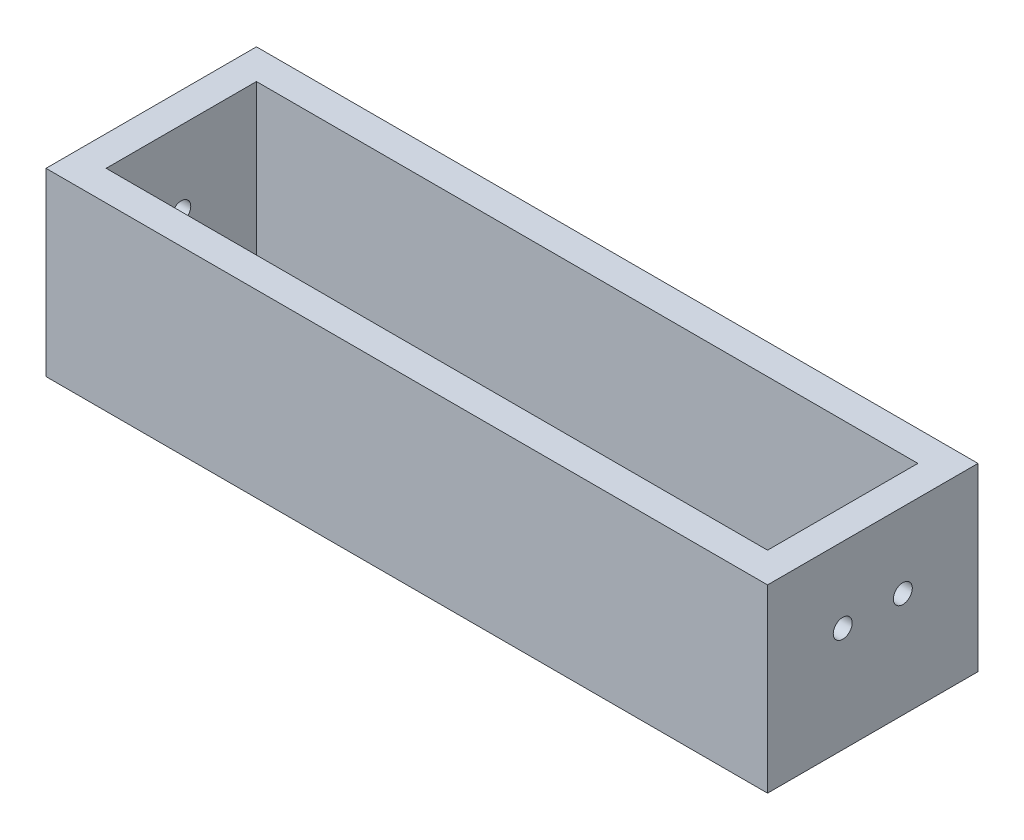
ISO-10303-21;
HEADER;
FILE_DESCRIPTION(('STEP AP214'),'2;1');
FILE_NAME('part.step','',(''),(''),'','','');
FILE_SCHEMA(('AUTOMOTIVE_DESIGN { 1 0 10303 214 1 1 1 1 }'));
ENDSEC;
DATA;
#1=APPLICATION_CONTEXT('core data for automotive mechanical design processes');
#2=APPLICATION_PROTOCOL_DEFINITION('international standard','automotive_design',2000,#1);
#3=PRODUCT_CONTEXT('',#1,'mechanical');
#4=PRODUCT('Part','Part','',(#3));
#5=PRODUCT_RELATED_PRODUCT_CATEGORY('part','',(#4));
#6=PRODUCT_DEFINITION_FORMATION('','',#4);
#7=PRODUCT_DEFINITION_CONTEXT('part definition',#1,'design');
#8=PRODUCT_DEFINITION('design','',#6,#7);
#9=PRODUCT_DEFINITION_SHAPE('','',#8);
#10=(LENGTH_UNIT() NAMED_UNIT(*) SI_UNIT(.MILLI.,.METRE.));
#11=(NAMED_UNIT(*) PLANE_ANGLE_UNIT() SI_UNIT($,.RADIAN.));
#12=(NAMED_UNIT(*) SI_UNIT($,.STERADIAN.) SOLID_ANGLE_UNIT());
#13=UNCERTAINTY_MEASURE_WITH_UNIT(LENGTH_MEASURE(1.E-05),#10,'distance_accuracy_value','');
#14=(GEOMETRIC_REPRESENTATION_CONTEXT(3) GLOBAL_UNCERTAINTY_ASSIGNED_CONTEXT((#13)) GLOBAL_UNIT_ASSIGNED_CONTEXT((#10,
#11,#12)) REPRESENTATION_CONTEXT('',''));
#15=CARTESIAN_POINT('',(0.,0.,0.));
#16=DIRECTION('',(0.,0.,1.));
#17=DIRECTION('',(1.,0.,0.));
#18=AXIS2_PLACEMENT_3D('',#15,#16,#17);
#19=CARTESIAN_POINT('',(38.1,3.175,11.1125));
#20=DIRECTION('',(-1.,0.,0.));
#21=DIRECTION('',(0.,0.,1.));
#22=AXIS2_PLACEMENT_3D('',#19,#20,#21);
#23=PLANE('',#22);
#24=CARTESIAN_POINT('',(38.1,11.1125,-3.175));
#25=DIRECTION('',(-1.,0.,0.));
#26=DIRECTION('',(0.,0.,1.));
#27=AXIS2_PLACEMENT_3D('',#24,#25,#26);
#28=CIRCLE('',#27,1.);
#29=CARTESIAN_POINT('',(38.1,11.1125,-2.175));
#30=VERTEX_POINT('',#29);
#31=EDGE_CURVE('E170',#30,#30,#28,.T.);
#32=ORIENTED_EDGE('',*,*,#31,.T.);
#33=EDGE_LOOP('',(#32));
#34=FACE_BOUND('',#33,.T.);
#35=CARTESIAN_POINT('',(38.1,11.1125,3.175));
#36=DIRECTION('',(-1.,0.,0.));
#37=DIRECTION('',(0.,0.,1.));
#38=AXIS2_PLACEMENT_3D('',#35,#36,#37);
#39=CIRCLE('',#38,1.);
#40=CARTESIAN_POINT('',(38.1,11.1125,4.175));
#41=VERTEX_POINT('',#40);
#42=EDGE_CURVE('E232',#41,#41,#39,.T.);
#43=ORIENTED_EDGE('',*,*,#42,.T.);
#44=EDGE_LOOP('',(#43));
#45=FACE_BOUND('',#44,.T.);
#46=DIRECTION('',(0.,0.,-1.));
#47=VECTOR('',#46,1.);
#48=CARTESIAN_POINT('',(38.1,0.,11.1125));
#49=LINE('',#48,#47);
#50=CARTESIAN_POINT('',(38.1,0.,11.1125));
#51=VERTEX_POINT('',#50);
#52=CARTESIAN_POINT('',(38.1,0.,-11.1125));
#53=VERTEX_POINT('',#52);
#54=EDGE_CURVE('E120',#51,#53,#49,.T.);
#55=ORIENTED_EDGE('',*,*,#54,.T.);
#56=DIRECTION('',(0.,-1.,0.));
#57=VECTOR('',#56,1.);
#58=CARTESIAN_POINT('',(38.1,3.175,-11.1125));
#59=LINE('',#58,#57);
#60=CARTESIAN_POINT('',(38.1,19.05,-11.1125));
#61=VERTEX_POINT('',#60);
#62=EDGE_CURVE('E11',#61,#53,#59,.T.);
#63=ORIENTED_EDGE('',*,*,#62,.F.);
#64=DIRECTION('',(0.,0.,-1.));
#65=VECTOR('',#64,1.);
#66=CARTESIAN_POINT('',(38.1,19.05,0.));
#67=LINE('',#66,#65);
#68=CARTESIAN_POINT('',(38.1,19.05,11.1125));
#69=VERTEX_POINT('',#68);
#70=EDGE_CURVE('E160',#69,#61,#67,.T.);
#71=ORIENTED_EDGE('',*,*,#70,.F.);
#72=DIRECTION('',(0.,-1.,0.));
#73=VECTOR('',#72,1.);
#74=CARTESIAN_POINT('',(38.1,3.175,11.1125));
#75=LINE('',#74,#73);
#76=EDGE_CURVE('E134',#69,#51,#75,.T.);
#77=ORIENTED_EDGE('',*,*,#76,.T.);
#78=EDGE_LOOP('',(#55,#63,#71,#77));
#79=FACE_BOUND('',#78,.T.);
#80=ADVANCED_FACE('F33',(#34,#45,#79),#23,.F.);
#81=CARTESIAN_POINT('',(-38.1,3.175,-11.1125));
#82=DIRECTION('',(0.,0.,1.));
#83=DIRECTION('',(1.,0.,0.));
#84=AXIS2_PLACEMENT_3D('',#81,#82,#83);
#85=PLANE('',#84);
#86=DIRECTION('',(-1.,0.,0.));
#87=VECTOR('',#86,1.);
#88=CARTESIAN_POINT('',(-38.1,0.,-11.1125));
#89=LINE('',#88,#87);
#90=CARTESIAN_POINT('',(-38.1,0.,-11.1125));
#91=VERTEX_POINT('',#90);
#92=EDGE_CURVE('E123',#53,#91,#89,.T.);
#93=ORIENTED_EDGE('',*,*,#92,.T.);
#94=DIRECTION('',(0.,-1.,0.));
#95=VECTOR('',#94,1.);
#96=CARTESIAN_POINT('',(-38.1,3.175,-11.1125));
#97=LINE('',#96,#95);
#98=CARTESIAN_POINT('',(-38.1,19.05,-11.1125));
#99=VERTEX_POINT('',#98);
#100=EDGE_CURVE('E40',#99,#91,#97,.T.);
#101=ORIENTED_EDGE('',*,*,#100,.F.);
#102=DIRECTION('',(-1.,0.,0.));
#103=VECTOR('',#102,1.);
#104=CARTESIAN_POINT('',(0.,19.05,-11.1125));
#105=LINE('',#104,#103);
#106=EDGE_CURVE('E161',#61,#99,#105,.T.);
#107=ORIENTED_EDGE('',*,*,#106,.F.);
#108=ORIENTED_EDGE('',*,*,#62,.T.);
#109=EDGE_LOOP('',(#93,#101,#107,#108));
#110=FACE_BOUND('',#109,.T.);
#111=ADVANCED_FACE('F182',(#110),#85,.F.);
#112=CARTESIAN_POINT('',(-38.1,3.175,11.1125));
#113=DIRECTION('',(1.,0.,0.));
#114=DIRECTION('',(0.,0.,-1.));
#115=AXIS2_PLACEMENT_3D('',#112,#113,#114);
#116=PLANE('',#115);
#117=CARTESIAN_POINT('',(-38.1,11.1125,0.));
#118=DIRECTION('',(1.,0.,0.));
#119=DIRECTION('',(0.,0.,-1.));
#120=AXIS2_PLACEMENT_3D('',#117,#118,#119);
#121=CIRCLE('',#120,1.);
#122=CARTESIAN_POINT('',(-38.1,11.1125,-1.));
#123=VERTEX_POINT('',#122);
#124=EDGE_CURVE('E227',#123,#123,#121,.T.);
#125=ORIENTED_EDGE('',*,*,#124,.T.);
#126=EDGE_LOOP('',(#125));
#127=FACE_BOUND('',#126,.T.);
#128=DIRECTION('',(0.,0.,1.));
#129=VECTOR('',#128,1.);
#130=CARTESIAN_POINT('',(-38.1,0.,11.1125));
#131=LINE('',#130,#129);
#132=CARTESIAN_POINT('',(-38.1,0.,11.1125));
#133=VERTEX_POINT('',#132);
#134=EDGE_CURVE('E130',#91,#133,#131,.T.);
#135=ORIENTED_EDGE('',*,*,#134,.T.);
#136=DIRECTION('',(0.,-1.,0.));
#137=VECTOR('',#136,1.);
#138=CARTESIAN_POINT('',(-38.1,3.175,11.1125));
#139=LINE('',#138,#137);
#140=CARTESIAN_POINT('',(-38.1,19.05,11.1125));
#141=VERTEX_POINT('',#140);
#142=EDGE_CURVE('E137',#141,#133,#139,.T.);
#143=ORIENTED_EDGE('',*,*,#142,.F.);
#144=DIRECTION('',(0.,0.,1.));
#145=VECTOR('',#144,1.);
#146=CARTESIAN_POINT('',(-38.1,19.05,0.));
#147=LINE('',#146,#145);
#148=EDGE_CURVE('E145',#99,#141,#147,.T.);
#149=ORIENTED_EDGE('',*,*,#148,.F.);
#150=ORIENTED_EDGE('',*,*,#100,.T.);
#151=EDGE_LOOP('',(#135,#143,#149,#150));
#152=FACE_BOUND('',#151,.T.);
#153=ADVANCED_FACE('F143',(#127,#152),#116,.F.);
#154=CARTESIAN_POINT('',(-38.1,3.175,11.1125));
#155=DIRECTION('',(0.,0.,-1.));
#156=DIRECTION('',(-1.,0.,0.));
#157=AXIS2_PLACEMENT_3D('',#154,#155,#156);
#158=PLANE('',#157);
#159=DIRECTION('',(1.,0.,0.));
#160=VECTOR('',#159,1.);
#161=CARTESIAN_POINT('',(-38.1,0.,11.1125));
#162=LINE('',#161,#160);
#163=EDGE_CURVE('E132',#133,#51,#162,.T.);
#164=ORIENTED_EDGE('',*,*,#163,.T.);
#165=ORIENTED_EDGE('',*,*,#76,.F.);
#166=DIRECTION('',(1.,0.,0.));
#167=VECTOR('',#166,1.);
#168=CARTESIAN_POINT('',(0.,19.05,11.1125));
#169=LINE('',#168,#167);
#170=EDGE_CURVE('E162',#141,#69,#169,.T.);
#171=ORIENTED_EDGE('',*,*,#170,.F.);
#172=ORIENTED_EDGE('',*,*,#142,.T.);
#173=EDGE_LOOP('',(#164,#165,#171,#172));
#174=FACE_BOUND('',#173,.T.);
#175=ADVANCED_FACE('F154',(#174),#158,.F.);
#176=CARTESIAN_POINT('',(0.,0.,0.));
#177=DIRECTION('',(0.,-1.,0.));
#178=DIRECTION('',(0.,0.,-1.));
#179=AXIS2_PLACEMENT_3D('',#176,#177,#178);
#180=PLANE('',#179);
#181=ORIENTED_EDGE('',*,*,#54,.F.);
#182=ORIENTED_EDGE('',*,*,#163,.F.);
#183=ORIENTED_EDGE('',*,*,#134,.F.);
#184=ORIENTED_EDGE('',*,*,#92,.F.);
#185=EDGE_LOOP('',(#181,#182,#183,#184));
#186=FACE_BOUND('',#185,.T.);
#187=ADVANCED_FACE('F152',(#186),#180,.T.);
#188=CARTESIAN_POINT('',(34.925,19.05,0.));
#189=DIRECTION('',(1.,0.,0.));
#190=DIRECTION('',(0.,0.,-1.));
#191=AXIS2_PLACEMENT_3D('',#188,#189,#190);
#192=PLANE('',#191);
#193=CARTESIAN_POINT('',(34.925,11.1125,-3.175));
#194=DIRECTION('',(-1.,0.,0.));
#195=DIRECTION('',(0.,0.,1.));
#196=AXIS2_PLACEMENT_3D('',#193,#194,#195);
#197=CIRCLE('',#196,1.);
#198=CARTESIAN_POINT('',(34.925,11.1125,-2.175));
#199=VERTEX_POINT('',#198);
#200=EDGE_CURVE('E237',#199,#199,#197,.T.);
#201=ORIENTED_EDGE('',*,*,#200,.F.);
#202=EDGE_LOOP('',(#201));
#203=FACE_BOUND('',#202,.T.);
#204=CARTESIAN_POINT('',(34.925,11.1125,3.175));
#205=DIRECTION('',(-1.,0.,0.));
#206=DIRECTION('',(0.,0.,1.));
#207=AXIS2_PLACEMENT_3D('',#204,#205,#206);
#208=CIRCLE('',#207,1.);
#209=CARTESIAN_POINT('',(34.925,11.1125,4.175));
#210=VERTEX_POINT('',#209);
#211=EDGE_CURVE('E240',#210,#210,#208,.T.);
#212=ORIENTED_EDGE('',*,*,#211,.F.);
#213=EDGE_LOOP('',(#212));
#214=FACE_BOUND('',#213,.T.);
#215=DIRECTION('',(0.,0.,1.));
#216=VECTOR('',#215,1.);
#217=CARTESIAN_POINT('',(34.925,3.175,0.));
#218=LINE('',#217,#216);
#219=CARTESIAN_POINT('',(34.925,3.175,-7.9375));
#220=VERTEX_POINT('',#219);
#221=CARTESIAN_POINT('',(34.925,3.175,7.9375));
#222=VERTEX_POINT('',#221);
#223=EDGE_CURVE('E119',#220,#222,#218,.T.);
#224=ORIENTED_EDGE('',*,*,#223,.T.);
#225=DIRECTION('',(0.,-1.,0.));
#226=VECTOR('',#225,1.);
#227=CARTESIAN_POINT('',(34.925,19.05,7.9375));
#228=LINE('',#227,#226);
#229=CARTESIAN_POINT('',(34.925,19.05,7.9375));
#230=VERTEX_POINT('',#229);
#231=EDGE_CURVE('E99',#230,#222,#228,.T.);
#232=ORIENTED_EDGE('',*,*,#231,.F.);
#233=DIRECTION('',(0.,0.,1.));
#234=VECTOR('',#233,1.);
#235=CARTESIAN_POINT('',(34.925,19.05,0.));
#236=LINE('',#235,#234);
#237=CARTESIAN_POINT('',(34.925,19.05,-7.9375));
#238=VERTEX_POINT('',#237);
#239=EDGE_CURVE('E106',#238,#230,#236,.T.);
#240=ORIENTED_EDGE('',*,*,#239,.F.);
#241=DIRECTION('',(0.,-1.,0.));
#242=VECTOR('',#241,1.);
#243=CARTESIAN_POINT('',(34.925,19.05,-7.9375));
#244=LINE('',#243,#242);
#245=EDGE_CURVE('E164',#238,#220,#244,.T.);
#246=ORIENTED_EDGE('',*,*,#245,.T.);
#247=EDGE_LOOP('',(#224,#232,#240,#246));
#248=FACE_BOUND('',#247,.T.);
#249=ADVANCED_FACE('F118',(#203,#214,#248),#192,.F.);
#250=CARTESIAN_POINT('',(0.,19.05,7.9375));
#251=DIRECTION('',(0.,0.,1.));
#252=DIRECTION('',(1.,0.,0.));
#253=AXIS2_PLACEMENT_3D('',#250,#251,#252);
#254=PLANE('',#253);
#255=DIRECTION('',(-1.,0.,0.));
#256=VECTOR('',#255,1.);
#257=CARTESIAN_POINT('',(0.,3.175,7.9375));
#258=LINE('',#257,#256);
#259=CARTESIAN_POINT('',(-34.925,3.175,7.93750000000001));
#260=VERTEX_POINT('',#259);
#261=EDGE_CURVE('E47',#222,#260,#258,.T.);
#262=ORIENTED_EDGE('',*,*,#261,.T.);
#263=DIRECTION('',(0.,-1.,0.));
#264=VECTOR('',#263,1.);
#265=CARTESIAN_POINT('',(-34.925,19.05,7.93750000000001));
#266=LINE('',#265,#264);
#267=CARTESIAN_POINT('',(-34.925,19.05,7.93750000000001));
#268=VERTEX_POINT('',#267);
#269=EDGE_CURVE('E101',#268,#260,#266,.T.);
#270=ORIENTED_EDGE('',*,*,#269,.F.);
#271=DIRECTION('',(-1.,0.,0.));
#272=VECTOR('',#271,1.);
#273=CARTESIAN_POINT('',(0.,19.05,7.9375));
#274=LINE('',#273,#272);
#275=EDGE_CURVE('E95',#230,#268,#274,.T.);
#276=ORIENTED_EDGE('',*,*,#275,.F.);
#277=ORIENTED_EDGE('',*,*,#231,.T.);
#278=EDGE_LOOP('',(#262,#270,#276,#277));
#279=FACE_BOUND('',#278,.T.);
#280=ADVANCED_FACE('F97',(#279),#254,.F.);
#281=CARTESIAN_POINT('',(-34.925,19.05,0.));
#282=DIRECTION('',(1.,0.,0.));
#283=DIRECTION('',(0.,0.,-1.));
#284=AXIS2_PLACEMENT_3D('',#281,#282,#283);
#285=PLANE('',#284);
#286=CARTESIAN_POINT('',(-34.925,11.1125,0.));
#287=DIRECTION('',(1.,0.,0.));
#288=DIRECTION('',(0.,0.,-1.));
#289=AXIS2_PLACEMENT_3D('',#286,#287,#288);
#290=CIRCLE('',#289,1.);
#291=CARTESIAN_POINT('',(-34.925,11.1125,-1.));
#292=VERTEX_POINT('',#291);
#293=EDGE_CURVE('E230',#292,#292,#290,.T.);
#294=ORIENTED_EDGE('',*,*,#293,.F.);
#295=EDGE_LOOP('',(#294));
#296=FACE_BOUND('',#295,.T.);
#297=DIRECTION('',(0.,0.,1.));
#298=VECTOR('',#297,1.);
#299=CARTESIAN_POINT('',(-34.925,3.175,0.));
#300=LINE('',#299,#298);
#301=CARTESIAN_POINT('',(-34.925,3.175,-7.9375));
#302=VERTEX_POINT('',#301);
#303=EDGE_CURVE('E52',#302,#260,#300,.T.);
#304=ORIENTED_EDGE('',*,*,#303,.F.);
#305=DIRECTION('',(0.,-1.,0.));
#306=VECTOR('',#305,1.);
#307=CARTESIAN_POINT('',(-34.925,19.05,-7.9375));
#308=LINE('',#307,#306);
#309=CARTESIAN_POINT('',(-34.925,19.05,-7.9375));
#310=VERTEX_POINT('',#309);
#311=EDGE_CURVE('E125',#310,#302,#308,.T.);
#312=ORIENTED_EDGE('',*,*,#311,.F.);
#313=DIRECTION('',(0.,0.,1.));
#314=VECTOR('',#313,1.);
#315=CARTESIAN_POINT('',(-34.925,19.05,0.));
#316=LINE('',#315,#314);
#317=EDGE_CURVE('E105',#310,#268,#316,.T.);
#318=ORIENTED_EDGE('',*,*,#317,.T.);
#319=ORIENTED_EDGE('',*,*,#269,.T.);
#320=EDGE_LOOP('',(#304,#312,#318,#319));
#321=FACE_BOUND('',#320,.T.);
#322=ADVANCED_FACE('F179',(#296,#321),#285,.T.);
#323=CARTESIAN_POINT('',(0.,19.05,-7.9375));
#324=DIRECTION('',(0.,0.,-1.));
#325=DIRECTION('',(-1.,0.,0.));
#326=AXIS2_PLACEMENT_3D('',#323,#324,#325);
#327=PLANE('',#326);
#328=DIRECTION('',(1.,0.,0.));
#329=VECTOR('',#328,1.);
#330=CARTESIAN_POINT('',(0.,3.175,-7.9375));
#331=LINE('',#330,#329);
#332=EDGE_CURVE('E116',#302,#220,#331,.T.);
#333=ORIENTED_EDGE('',*,*,#332,.T.);
#334=ORIENTED_EDGE('',*,*,#245,.F.);
#335=DIRECTION('',(1.,0.,0.));
#336=VECTOR('',#335,1.);
#337=CARTESIAN_POINT('',(0.,19.05,-7.9375));
#338=LINE('',#337,#336);
#339=EDGE_CURVE('E112',#310,#238,#338,.T.);
#340=ORIENTED_EDGE('',*,*,#339,.F.);
#341=ORIENTED_EDGE('',*,*,#311,.T.);
#342=EDGE_LOOP('',(#333,#334,#340,#341));
#343=FACE_BOUND('',#342,.T.);
#344=ADVANCED_FACE('F177',(#343),#327,.F.);
#345=CARTESIAN_POINT('',(0.,19.05,0.));
#346=DIRECTION('',(0.,1.,0.));
#347=DIRECTION('',(0.,0.,1.));
#348=AXIS2_PLACEMENT_3D('',#345,#346,#347);
#349=PLANE('',#348);
#350=ORIENTED_EDGE('',*,*,#239,.T.);
#351=ORIENTED_EDGE('',*,*,#275,.T.);
#352=ORIENTED_EDGE('',*,*,#317,.F.);
#353=ORIENTED_EDGE('',*,*,#339,.T.);
#354=EDGE_LOOP('',(#350,#351,#352,#353));
#355=FACE_BOUND('',#354,.T.);
#356=ORIENTED_EDGE('',*,*,#148,.T.);
#357=ORIENTED_EDGE('',*,*,#170,.T.);
#358=ORIENTED_EDGE('',*,*,#70,.T.);
#359=ORIENTED_EDGE('',*,*,#106,.T.);
#360=EDGE_LOOP('',(#356,#357,#358,#359));
#361=FACE_BOUND('',#360,.T.);
#362=ADVANCED_FACE('F109',(#355,#361),#349,.T.);
#363=CARTESIAN_POINT('',(0.,3.175,0.));
#364=DIRECTION('',(0.,-1.,0.));
#365=DIRECTION('',(0.,0.,-1.));
#366=AXIS2_PLACEMENT_3D('',#363,#364,#365);
#367=PLANE('',#366);
#368=ORIENTED_EDGE('',*,*,#223,.F.);
#369=ORIENTED_EDGE('',*,*,#332,.F.);
#370=ORIENTED_EDGE('',*,*,#303,.T.);
#371=ORIENTED_EDGE('',*,*,#261,.F.);
#372=EDGE_LOOP('',(#368,#369,#370,#371));
#373=FACE_BOUND('',#372,.T.);
#374=ADVANCED_FACE('F196',(#373),#367,.F.);
#375=CARTESIAN_POINT('',(38.1,11.1125,3.175));
#376=DIRECTION('',(-1.,0.,0.));
#377=DIRECTION('',(0.,0.,1.));
#378=AXIS2_PLACEMENT_3D('',#375,#376,#377);
#379=CYLINDRICAL_SURFACE('',#378,1.);
#380=ORIENTED_EDGE('',*,*,#42,.F.);
#381=EDGE_LOOP('',(#380));
#382=FACE_BOUND('',#381,.T.);
#383=ORIENTED_EDGE('',*,*,#211,.T.);
#384=EDGE_LOOP('',(#383));
#385=FACE_BOUND('',#384,.T.);
#386=ADVANCED_FACE('F199',(#382,#385),#379,.F.);
#387=CARTESIAN_POINT('',(38.1,11.1125,-3.175));
#388=DIRECTION('',(-1.,0.,0.));
#389=DIRECTION('',(0.,0.,1.));
#390=AXIS2_PLACEMENT_3D('',#387,#388,#389);
#391=CYLINDRICAL_SURFACE('',#390,1.);
#392=ORIENTED_EDGE('',*,*,#31,.F.);
#393=EDGE_LOOP('',(#392));
#394=FACE_BOUND('',#393,.T.);
#395=ORIENTED_EDGE('',*,*,#200,.T.);
#396=EDGE_LOOP('',(#395));
#397=FACE_BOUND('',#396,.T.);
#398=ADVANCED_FACE('F214',(#394,#397),#391,.F.);
#399=CARTESIAN_POINT('',(-38.1,11.1125,0.));
#400=DIRECTION('',(1.,0.,0.));
#401=DIRECTION('',(0.,0.,-1.));
#402=AXIS2_PLACEMENT_3D('',#399,#400,#401);
#403=CYLINDRICAL_SURFACE('',#402,1.);
#404=ORIENTED_EDGE('',*,*,#124,.F.);
#405=EDGE_LOOP('',(#404));
#406=FACE_BOUND('',#405,.T.);
#407=ORIENTED_EDGE('',*,*,#293,.T.);
#408=EDGE_LOOP('',(#407));
#409=FACE_BOUND('',#408,.T.);
#410=ADVANCED_FACE('F218',(#406,#409),#403,.F.);
#411=CLOSED_SHELL('',(#80,#111,#153,#175,#187,#249,#280,#322,#344,#362,#374,#386,#398,#410));
#412=MANIFOLD_SOLID_BREP('B2',#411);
#413=ADVANCED_BREP_SHAPE_REPRESENTATION('',(#18,#412),#14);
#414=SHAPE_DEFINITION_REPRESENTATION(#9,#413);
ENDSEC;
END-ISO-10303-21;
